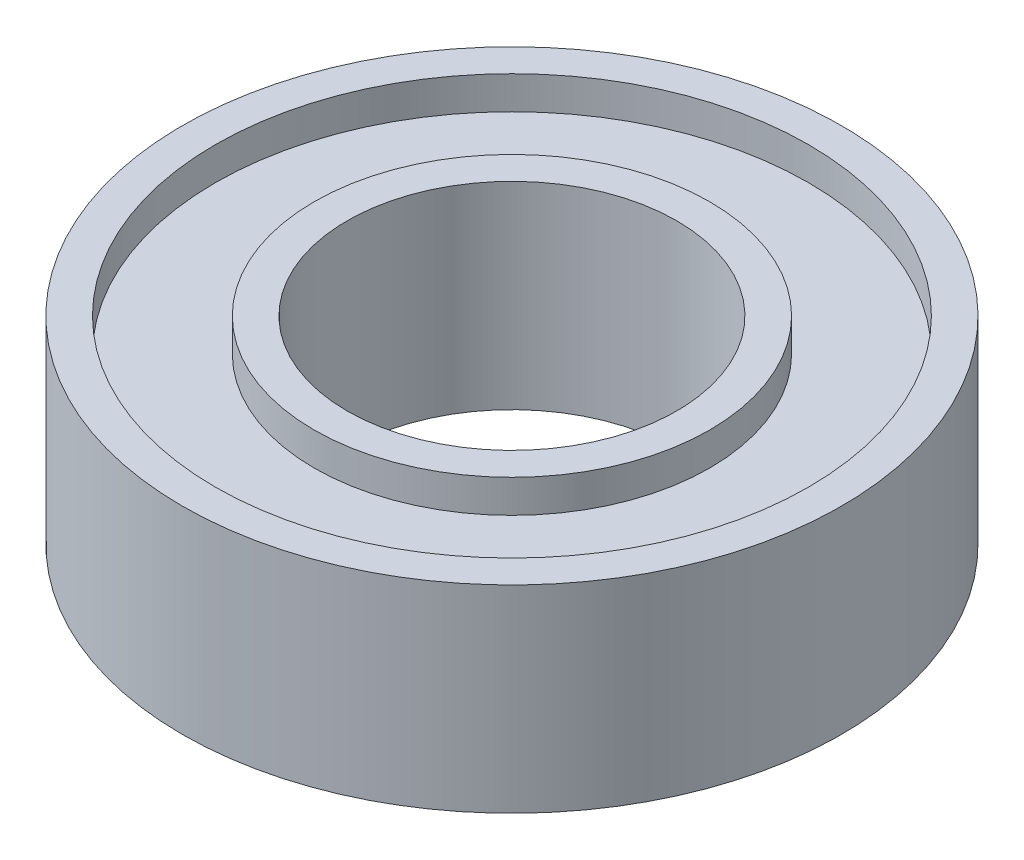
ISO-10303-21;
HEADER;
FILE_DESCRIPTION(('STEP AP214'),'2;1');
FILE_NAME('part.step','',(''),(''),'','','');
FILE_SCHEMA(('AUTOMOTIVE_DESIGN { 1 0 10303 214 1 1 1 1 }'));
ENDSEC;
DATA;
#1=APPLICATION_CONTEXT('core data for automotive mechanical design processes');
#2=APPLICATION_PROTOCOL_DEFINITION('international standard','automotive_design',2000,#1);
#3=PRODUCT_CONTEXT('',#1,'mechanical');
#4=PRODUCT('Part','Part','',(#3));
#5=PRODUCT_RELATED_PRODUCT_CATEGORY('part','',(#4));
#6=PRODUCT_DEFINITION_FORMATION('','',#4);
#7=PRODUCT_DEFINITION_CONTEXT('part definition',#1,'design');
#8=PRODUCT_DEFINITION('design','',#6,#7);
#9=PRODUCT_DEFINITION_SHAPE('','',#8);
#10=(LENGTH_UNIT() NAMED_UNIT(*) SI_UNIT(.MILLI.,.METRE.));
#11=(NAMED_UNIT(*) PLANE_ANGLE_UNIT() SI_UNIT($,.RADIAN.));
#12=(NAMED_UNIT(*) SI_UNIT($,.STERADIAN.) SOLID_ANGLE_UNIT());
#13=UNCERTAINTY_MEASURE_WITH_UNIT(LENGTH_MEASURE(1.E-05),#10,'distance_accuracy_value','');
#14=(GEOMETRIC_REPRESENTATION_CONTEXT(3) GLOBAL_UNCERTAINTY_ASSIGNED_CONTEXT((#13)) GLOBAL_UNIT_ASSIGNED_CONTEXT((#10,
#11,#12)) REPRESENTATION_CONTEXT('',''));
#15=CARTESIAN_POINT('',(0.,0.,0.));
#16=DIRECTION('',(0.,0.,1.));
#17=DIRECTION('',(1.,0.,0.));
#18=AXIS2_PLACEMENT_3D('',#15,#16,#17);
#19=CARTESIAN_POINT('',(0.,0.,0.));
#20=DIRECTION('',(0.,1.,0.));
#21=DIRECTION('',(0.,0.,1.));
#22=AXIS2_PLACEMENT_3D('',#19,#20,#21);
#23=PLANE('',#22);
#24=CARTESIAN_POINT('',(0.,0.,0.));
#25=DIRECTION('',(0.,1.,0.));
#26=DIRECTION('',(0.,0.,1.));
#27=AXIS2_PLACEMENT_3D('',#24,#25,#26);
#28=CIRCLE('',#27,2.5);
#29=CARTESIAN_POINT('',(0.,0.,2.5));
#30=VERTEX_POINT('',#29);
#31=EDGE_CURVE('E43',#30,#30,#28,.T.);
#32=ORIENTED_EDGE('',*,*,#31,.T.);
#33=EDGE_LOOP('',(#32));
#34=FACE_BOUND('',#33,.T.);
#35=CARTESIAN_POINT('',(0.,0.,0.));
#36=DIRECTION('',(0.,1.,0.));
#37=DIRECTION('',(0.,0.,1.));
#38=AXIS2_PLACEMENT_3D('',#35,#36,#37);
#39=CIRCLE('',#38,3.);
#40=CARTESIAN_POINT('',(0.,0.,3.));
#41=VERTEX_POINT('',#40);
#42=EDGE_CURVE('E67',#41,#41,#39,.T.);
#43=ORIENTED_EDGE('',*,*,#42,.F.);
#44=EDGE_LOOP('',(#43));
#45=FACE_BOUND('',#44,.T.);
#46=ADVANCED_FACE('F30',(#34,#45),#23,.F.);
#47=CARTESIAN_POINT('',(0.,3.,0.));
#48=DIRECTION('',(0.,1.,0.));
#49=DIRECTION('',(0.,0.,1.));
#50=AXIS2_PLACEMENT_3D('',#47,#48,#49);
#51=PLANE('',#50);
#52=CARTESIAN_POINT('',(0.,3.,0.));
#53=DIRECTION('',(0.,1.,0.));
#54=DIRECTION('',(0.,0.,1.));
#55=AXIS2_PLACEMENT_3D('',#52,#53,#54);
#56=CIRCLE('',#55,2.5);
#57=CARTESIAN_POINT('',(0.,3.,2.5));
#58=VERTEX_POINT('',#57);
#59=EDGE_CURVE('E41',#58,#58,#56,.T.);
#60=ORIENTED_EDGE('',*,*,#59,.F.);
#61=EDGE_LOOP('',(#60));
#62=FACE_BOUND('',#61,.T.);
#63=CARTESIAN_POINT('',(0.,3.,0.));
#64=DIRECTION('',(0.,1.,0.));
#65=DIRECTION('',(0.,0.,1.));
#66=AXIS2_PLACEMENT_3D('',#63,#64,#65);
#67=CIRCLE('',#66,3.);
#68=CARTESIAN_POINT('',(0.,3.,3.));
#69=VERTEX_POINT('',#68);
#70=EDGE_CURVE('E55',#69,#69,#67,.T.);
#71=ORIENTED_EDGE('',*,*,#70,.T.);
#72=EDGE_LOOP('',(#71));
#73=FACE_BOUND('',#72,.T.);
#74=ADVANCED_FACE('F83',(#62,#73),#51,.T.);
#75=CARTESIAN_POINT('',(0.,3.,0.));
#76=DIRECTION('',(0.,1.,0.));
#77=DIRECTION('',(0.,0.,1.));
#78=AXIS2_PLACEMENT_3D('',#75,#76,#77);
#79=CIRCLE('',#78,4.5);
#80=CARTESIAN_POINT('',(0.,3.,4.5));
#81=VERTEX_POINT('',#80);
#82=EDGE_CURVE('E49',#81,#81,#79,.T.);
#83=ORIENTED_EDGE('',*,*,#82,.F.);
#84=EDGE_LOOP('',(#83));
#85=FACE_BOUND('',#84,.T.);
#86=CARTESIAN_POINT('',(0.,3.,0.));
#87=DIRECTION('',(0.,1.,0.));
#88=DIRECTION('',(0.,0.,1.));
#89=AXIS2_PLACEMENT_3D('',#86,#87,#88);
#90=CIRCLE('',#89,5.);
#91=CARTESIAN_POINT('',(0.,3.,5.));
#92=VERTEX_POINT('',#91);
#93=EDGE_CURVE('E10',#92,#92,#90,.T.);
#94=ORIENTED_EDGE('',*,*,#93,.T.);
#95=EDGE_LOOP('',(#94));
#96=FACE_BOUND('',#95,.T.);
#97=ADVANCED_FACE('F89',(#85,#96),#51,.T.);
#98=CARTESIAN_POINT('',(0.,0.,0.));
#99=DIRECTION('',(0.,1.,0.));
#100=DIRECTION('',(0.,0.,1.));
#101=AXIS2_PLACEMENT_3D('',#98,#99,#100);
#102=CIRCLE('',#101,4.5);
#103=CARTESIAN_POINT('',(0.,0.,4.5));
#104=VERTEX_POINT('',#103);
#105=EDGE_CURVE('E61',#104,#104,#102,.T.);
#106=ORIENTED_EDGE('',*,*,#105,.T.);
#107=EDGE_LOOP('',(#106));
#108=FACE_BOUND('',#107,.T.);
#109=CARTESIAN_POINT('',(0.,0.,0.));
#110=DIRECTION('',(0.,1.,0.));
#111=DIRECTION('',(0.,0.,1.));
#112=AXIS2_PLACEMENT_3D('',#109,#110,#111);
#113=CIRCLE('',#112,5.);
#114=CARTESIAN_POINT('',(0.,0.,5.));
#115=VERTEX_POINT('',#114);
#116=EDGE_CURVE('E34',#115,#115,#113,.T.);
#117=ORIENTED_EDGE('',*,*,#116,.F.);
#118=EDGE_LOOP('',(#117));
#119=FACE_BOUND('',#118,.T.);
#120=ADVANCED_FACE('F85',(#108,#119),#23,.F.);
#121=CARTESIAN_POINT('',(0.,3.,0.));
#122=DIRECTION('',(0.,-1.,0.));
#123=DIRECTION('',(0.,0.,-1.));
#124=AXIS2_PLACEMENT_3D('',#121,#122,#123);
#125=CYLINDRICAL_SURFACE('',#124,5.);
#126=ORIENTED_EDGE('',*,*,#93,.F.);
#127=EDGE_LOOP('',(#126));
#128=FACE_BOUND('',#127,.T.);
#129=ORIENTED_EDGE('',*,*,#116,.T.);
#130=EDGE_LOOP('',(#129));
#131=FACE_BOUND('',#130,.T.);
#132=ADVANCED_FACE('F32',(#128,#131),#125,.T.);
#133=CARTESIAN_POINT('',(0.,3.,0.));
#134=DIRECTION('',(0.,-1.,0.));
#135=DIRECTION('',(0.,0.,-1.));
#136=AXIS2_PLACEMENT_3D('',#133,#134,#135);
#137=CYLINDRICAL_SURFACE('',#136,2.5);
#138=ORIENTED_EDGE('',*,*,#59,.T.);
#139=EDGE_LOOP('',(#138));
#140=FACE_BOUND('',#139,.T.);
#141=ORIENTED_EDGE('',*,*,#31,.F.);
#142=EDGE_LOOP('',(#141));
#143=FACE_BOUND('',#142,.T.);
#144=ADVANCED_FACE('F98',(#140,#143),#137,.F.);
#145=CARTESIAN_POINT('',(0.,2.5,0.));
#146=DIRECTION('',(0.,1.,0.));
#147=DIRECTION('',(0.,0.,1.));
#148=AXIS2_PLACEMENT_3D('',#145,#146,#147);
#149=CYLINDRICAL_SURFACE('',#148,4.5);
#150=CARTESIAN_POINT('',(0.,2.5,0.));
#151=DIRECTION('',(0.,1.,0.));
#152=DIRECTION('',(0.,0.,1.));
#153=AXIS2_PLACEMENT_3D('',#150,#151,#152);
#154=CIRCLE('',#153,4.5);
#155=CARTESIAN_POINT('',(0.,2.5,4.5));
#156=VERTEX_POINT('',#155);
#157=EDGE_CURVE('E46',#156,#156,#154,.T.);
#158=ORIENTED_EDGE('',*,*,#157,.F.);
#159=EDGE_LOOP('',(#158));
#160=FACE_BOUND('',#159,.T.);
#161=ORIENTED_EDGE('',*,*,#82,.T.);
#162=EDGE_LOOP('',(#161));
#163=FACE_BOUND('',#162,.T.);
#164=ADVANCED_FACE('F122',(#160,#163),#149,.F.);
#165=CARTESIAN_POINT('',(0.,2.5,0.));
#166=DIRECTION('',(0.,1.,0.));
#167=DIRECTION('',(0.,0.,1.));
#168=AXIS2_PLACEMENT_3D('',#165,#166,#167);
#169=PLANE('',#168);
#170=CARTESIAN_POINT('',(0.,2.5,0.));
#171=DIRECTION('',(0.,1.,0.));
#172=DIRECTION('',(0.,0.,1.));
#173=AXIS2_PLACEMENT_3D('',#170,#171,#172);
#174=CIRCLE('',#173,3.);
#175=CARTESIAN_POINT('',(0.,2.5,3.));
#176=VERTEX_POINT('',#175);
#177=EDGE_CURVE('E52',#176,#176,#174,.T.);
#178=ORIENTED_EDGE('',*,*,#177,.F.);
#179=EDGE_LOOP('',(#178));
#180=FACE_BOUND('',#179,.T.);
#181=ORIENTED_EDGE('',*,*,#157,.T.);
#182=EDGE_LOOP('',(#181));
#183=FACE_BOUND('',#182,.T.);
#184=ADVANCED_FACE('F118',(#180,#183),#169,.T.);
#185=CARTESIAN_POINT('',(0.,2.5,0.));
#186=DIRECTION('',(0.,1.,0.));
#187=DIRECTION('',(0.,0.,1.));
#188=AXIS2_PLACEMENT_3D('',#185,#186,#187);
#189=CYLINDRICAL_SURFACE('',#188,3.);
#190=ORIENTED_EDGE('',*,*,#177,.T.);
#191=EDGE_LOOP('',(#190));
#192=FACE_BOUND('',#191,.T.);
#193=ORIENTED_EDGE('',*,*,#70,.F.);
#194=EDGE_LOOP('',(#193));
#195=FACE_BOUND('',#194,.T.);
#196=ADVANCED_FACE('F112',(#192,#195),#189,.T.);
#197=CARTESIAN_POINT('',(0.,0.5,0.));
#198=DIRECTION('',(0.,-1.,0.));
#199=DIRECTION('',(0.,0.,1.));
#200=AXIS2_PLACEMENT_3D('',#197,#198,#199);
#201=PLANE('',#200);
#202=CARTESIAN_POINT('',(0.,0.5,0.));
#203=DIRECTION('',(0.,1.,0.));
#204=DIRECTION('',(0.,0.,1.));
#205=AXIS2_PLACEMENT_3D('',#202,#203,#204);
#206=CIRCLE('',#205,4.5);
#207=CARTESIAN_POINT('',(0.,0.5,4.5));
#208=VERTEX_POINT('',#207);
#209=EDGE_CURVE('E58',#208,#208,#206,.T.);
#210=ORIENTED_EDGE('',*,*,#209,.F.);
#211=EDGE_LOOP('',(#210));
#212=FACE_BOUND('',#211,.T.);
#213=CARTESIAN_POINT('',(0.,0.5,0.));
#214=DIRECTION('',(0.,1.,0.));
#215=DIRECTION('',(0.,0.,1.));
#216=AXIS2_PLACEMENT_3D('',#213,#214,#215);
#217=CIRCLE('',#216,3.);
#218=CARTESIAN_POINT('',(0.,0.5,3.));
#219=VERTEX_POINT('',#218);
#220=EDGE_CURVE('E64',#219,#219,#217,.T.);
#221=ORIENTED_EDGE('',*,*,#220,.T.);
#222=EDGE_LOOP('',(#221));
#223=FACE_BOUND('',#222,.T.);
#224=ADVANCED_FACE('F73',(#212,#223),#201,.T.);
#225=CARTESIAN_POINT('',(0.,0.5,0.));
#226=DIRECTION('',(0.,-1.,0.));
#227=DIRECTION('',(0.,0.,-1.));
#228=AXIS2_PLACEMENT_3D('',#225,#226,#227);
#229=CYLINDRICAL_SURFACE('',#228,4.5);
#230=ORIENTED_EDGE('',*,*,#209,.T.);
#231=EDGE_LOOP('',(#230));
#232=FACE_BOUND('',#231,.T.);
#233=ORIENTED_EDGE('',*,*,#105,.F.);
#234=EDGE_LOOP('',(#233));
#235=FACE_BOUND('',#234,.T.);
#236=ADVANCED_FACE('F78',(#232,#235),#229,.F.);
#237=CARTESIAN_POINT('',(0.,0.5,0.));
#238=DIRECTION('',(0.,-1.,0.));
#239=DIRECTION('',(0.,0.,-1.));
#240=AXIS2_PLACEMENT_3D('',#237,#238,#239);
#241=CYLINDRICAL_SURFACE('',#240,3.);
#242=ORIENTED_EDGE('',*,*,#220,.F.);
#243=EDGE_LOOP('',(#242));
#244=FACE_BOUND('',#243,.T.);
#245=ORIENTED_EDGE('',*,*,#42,.T.);
#246=EDGE_LOOP('',(#245));
#247=FACE_BOUND('',#246,.T.);
#248=ADVANCED_FACE('F75',(#244,#247),#241,.T.);
#249=CLOSED_SHELL('',(#46,#74,#97,#120,#132,#144,#164,#184,#196,#224,#236,#248));
#250=MANIFOLD_SOLID_BREP('B2',#249);
#251=ADVANCED_BREP_SHAPE_REPRESENTATION('',(#18,#250),#14);
#252=SHAPE_DEFINITION_REPRESENTATION(#9,#251);
ENDSEC;
END-ISO-10303-21;
